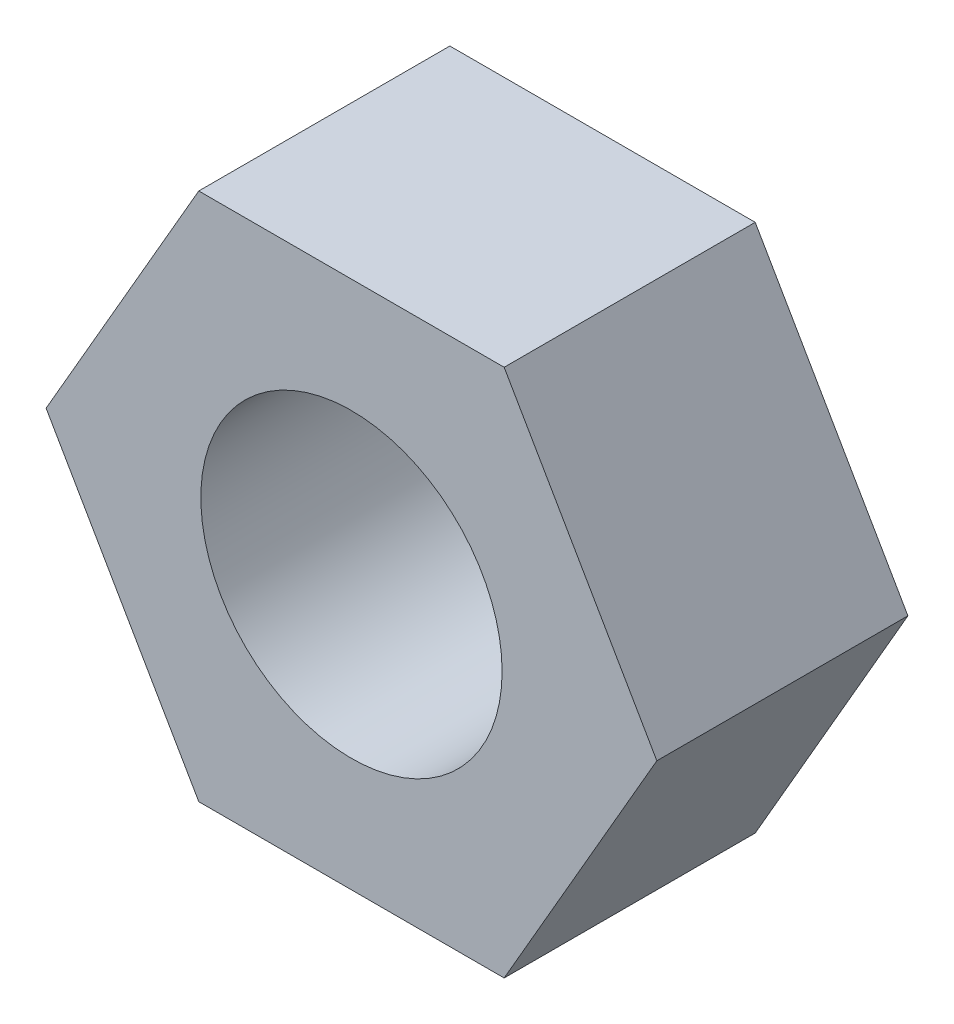
ISO-10303-21;
HEADER;
FILE_DESCRIPTION(('STEP AP214'),'2;1');
FILE_NAME('part.step','',(''),(''),'','','');
FILE_SCHEMA(('AUTOMOTIVE_DESIGN { 1 0 10303 214 1 1 1 1 }'));
ENDSEC;
DATA;
#1=APPLICATION_CONTEXT('core data for automotive mechanical design processes');
#2=APPLICATION_PROTOCOL_DEFINITION('international standard','automotive_design',2000,#1);
#3=PRODUCT_CONTEXT('',#1,'mechanical');
#4=PRODUCT('Part','Part','',(#3));
#5=PRODUCT_RELATED_PRODUCT_CATEGORY('part','',(#4));
#6=PRODUCT_DEFINITION_FORMATION('','',#4);
#7=PRODUCT_DEFINITION_CONTEXT('part definition',#1,'design');
#8=PRODUCT_DEFINITION('design','',#6,#7);
#9=PRODUCT_DEFINITION_SHAPE('','',#8);
#10=(LENGTH_UNIT() NAMED_UNIT(*) SI_UNIT(.MILLI.,.METRE.));
#11=(NAMED_UNIT(*) PLANE_ANGLE_UNIT() SI_UNIT($,.RADIAN.));
#12=(NAMED_UNIT(*) SI_UNIT($,.STERADIAN.) SOLID_ANGLE_UNIT());
#13=UNCERTAINTY_MEASURE_WITH_UNIT(LENGTH_MEASURE(1.E-05),#10,'distance_accuracy_value','');
#14=(GEOMETRIC_REPRESENTATION_CONTEXT(3) GLOBAL_UNCERTAINTY_ASSIGNED_CONTEXT((#13)) GLOBAL_UNIT_ASSIGNED_CONTEXT((#10,
#11,#12)) REPRESENTATION_CONTEXT('',''));
#15=CARTESIAN_POINT('',(0.,0.,0.));
#16=DIRECTION('',(0.,0.,1.));
#17=DIRECTION('',(1.,0.,0.));
#18=AXIS2_PLACEMENT_3D('',#15,#16,#17);
#19=CARTESIAN_POINT('',(4.56106712659807,0.,3.75));
#20=DIRECTION('',(-0.866025403784438,-0.5,0.));
#21=DIRECTION('',(0.5,-0.866025403784439,0.));
#22=AXIS2_PLACEMENT_3D('',#19,#20,#21);
#23=PLANE('',#22);
#24=DIRECTION('',(-0.5,0.866025403784438,0.));
#25=VECTOR('',#24,1.);
#26=CARTESIAN_POINT('',(4.56106712659807,0.,0.));
#27=LINE('',#26,#25);
#28=CARTESIAN_POINT('',(4.56106712659807,0.,0.));
#29=VERTEX_POINT('',#28);
#30=CARTESIAN_POINT('',(2.28053356329905,3.95,0.));
#31=VERTEX_POINT('',#30);
#32=EDGE_CURVE('E116',#29,#31,#27,.T.);
#33=ORIENTED_EDGE('',*,*,#32,.T.);
#34=DIRECTION('',(0.,0.,-1.));
#35=VECTOR('',#34,1.);
#36=CARTESIAN_POINT('',(2.28053356329905,3.95,3.75));
#37=LINE('',#36,#35);
#38=CARTESIAN_POINT('',(2.28053356329905,3.95,3.75));
#39=VERTEX_POINT('',#38);
#40=EDGE_CURVE('E11',#39,#31,#37,.T.);
#41=ORIENTED_EDGE('',*,*,#40,.F.);
#42=DIRECTION('',(-0.5,0.866025403784438,0.));
#43=VECTOR('',#42,1.);
#44=CARTESIAN_POINT('',(4.56106712659807,0.,3.75));
#45=LINE('',#44,#43);
#46=CARTESIAN_POINT('',(4.56106712659807,0.,3.75));
#47=VERTEX_POINT('',#46);
#48=EDGE_CURVE('E127',#47,#39,#45,.T.);
#49=ORIENTED_EDGE('',*,*,#48,.F.);
#50=DIRECTION('',(0.,0.,-1.));
#51=VECTOR('',#50,1.);
#52=CARTESIAN_POINT('',(4.56106712659807,0.,3.75));
#53=LINE('',#52,#51);
#54=EDGE_CURVE('E112',#47,#29,#53,.T.);
#55=ORIENTED_EDGE('',*,*,#54,.T.);
#56=EDGE_LOOP('',(#33,#41,#49,#55));
#57=FACE_BOUND('',#56,.T.);
#58=ADVANCED_FACE('F32',(#57),#23,.F.);
#59=CARTESIAN_POINT('',(2.28053356329905,3.95,3.75));
#60=DIRECTION('',(0.,-1.,0.));
#61=DIRECTION('',(0.,0.,-1.));
#62=AXIS2_PLACEMENT_3D('',#59,#60,#61);
#63=PLANE('',#62);
#64=DIRECTION('',(-1.,0.,0.));
#65=VECTOR('',#64,1.);
#66=CARTESIAN_POINT('',(2.28053356329905,3.95,0.));
#67=LINE('',#66,#65);
#68=CARTESIAN_POINT('',(-2.280533563299,3.95,0.));
#69=VERTEX_POINT('',#68);
#70=EDGE_CURVE('E119',#31,#69,#67,.T.);
#71=ORIENTED_EDGE('',*,*,#70,.T.);
#72=DIRECTION('',(0.,0.,-1.));
#73=VECTOR('',#72,1.);
#74=CARTESIAN_POINT('',(-2.280533563299,3.95,3.75));
#75=LINE('',#74,#73);
#76=CARTESIAN_POINT('',(-2.280533563299,3.95,3.75));
#77=VERTEX_POINT('',#76);
#78=EDGE_CURVE('E40',#77,#69,#75,.T.);
#79=ORIENTED_EDGE('',*,*,#78,.F.);
#80=DIRECTION('',(-1.,0.,0.));
#81=VECTOR('',#80,1.);
#82=CARTESIAN_POINT('',(2.28053356329905,3.95,3.75));
#83=LINE('',#82,#81);
#84=EDGE_CURVE('E85',#39,#77,#83,.T.);
#85=ORIENTED_EDGE('',*,*,#84,.F.);
#86=ORIENTED_EDGE('',*,*,#40,.T.);
#87=EDGE_LOOP('',(#71,#79,#85,#86));
#88=FACE_BOUND('',#87,.T.);
#89=ADVANCED_FACE('F152',(#88),#63,.F.);
#90=CARTESIAN_POINT('',(-2.280533563299,3.95,3.75));
#91=DIRECTION('',(0.866025403784439,-0.5,0.));
#92=DIRECTION('',(0.5,0.866025403784439,0.));
#93=AXIS2_PLACEMENT_3D('',#90,#91,#92);
#94=PLANE('',#93);
#95=DIRECTION('',(-0.5,-0.866025403784439,0.));
#96=VECTOR('',#95,1.);
#97=CARTESIAN_POINT('',(-2.280533563299,3.95,0.));
#98=LINE('',#97,#96);
#99=CARTESIAN_POINT('',(-4.56106712659803,0.,0.));
#100=VERTEX_POINT('',#99);
#101=EDGE_CURVE('E122',#69,#100,#98,.T.);
#102=ORIENTED_EDGE('',*,*,#101,.T.);
#103=DIRECTION('',(0.,0.,-1.));
#104=VECTOR('',#103,1.);
#105=CARTESIAN_POINT('',(-4.56106712659803,0.,3.75));
#106=LINE('',#105,#104);
#107=CARTESIAN_POINT('',(-4.56106712659803,0.,3.75));
#108=VERTEX_POINT('',#107);
#109=EDGE_CURVE('E107',#108,#100,#106,.T.);
#110=ORIENTED_EDGE('',*,*,#109,.F.);
#111=DIRECTION('',(-0.5,-0.866025403784439,0.));
#112=VECTOR('',#111,1.);
#113=CARTESIAN_POINT('',(-2.280533563299,3.95,3.75));
#114=LINE('',#113,#112);
#115=EDGE_CURVE('E98',#77,#108,#114,.T.);
#116=ORIENTED_EDGE('',*,*,#115,.F.);
#117=ORIENTED_EDGE('',*,*,#78,.T.);
#118=EDGE_LOOP('',(#102,#110,#116,#117));
#119=FACE_BOUND('',#118,.T.);
#120=ADVANCED_FACE('F133',(#119),#94,.F.);
#121=CARTESIAN_POINT('',(-4.56106712659803,0.,3.75));
#122=DIRECTION('',(0.866025403784438,0.500000000000001,0.));
#123=DIRECTION('',(-0.500000000000001,0.866025403784438,0.));
#124=AXIS2_PLACEMENT_3D('',#121,#122,#123);
#125=PLANE('',#124);
#126=DIRECTION('',(0.500000000000001,-0.866025403784438,0.));
#127=VECTOR('',#126,1.);
#128=CARTESIAN_POINT('',(-4.56106712659803,0.,0.));
#129=LINE('',#128,#127);
#130=CARTESIAN_POINT('',(-2.280533563299,-3.95000000000002,0.));
#131=VERTEX_POINT('',#130);
#132=EDGE_CURVE('E106',#100,#131,#129,.T.);
#133=ORIENTED_EDGE('',*,*,#132,.T.);
#134=DIRECTION('',(0.,0.,-1.));
#135=VECTOR('',#134,1.);
#136=CARTESIAN_POINT('',(-2.280533563299,-3.95000000000002,3.75));
#137=LINE('',#136,#135);
#138=CARTESIAN_POINT('',(-2.280533563299,-3.95000000000002,3.75));
#139=VERTEX_POINT('',#138);
#140=EDGE_CURVE('E103',#139,#131,#137,.T.);
#141=ORIENTED_EDGE('',*,*,#140,.F.);
#142=DIRECTION('',(0.500000000000001,-0.866025403784438,0.));
#143=VECTOR('',#142,1.);
#144=CARTESIAN_POINT('',(-4.56106712659803,0.,3.75));
#145=LINE('',#144,#143);
#146=EDGE_CURVE('E92',#108,#139,#145,.T.);
#147=ORIENTED_EDGE('',*,*,#146,.F.);
#148=ORIENTED_EDGE('',*,*,#109,.T.);
#149=EDGE_LOOP('',(#133,#141,#147,#148));
#150=FACE_BOUND('',#149,.T.);
#151=ADVANCED_FACE('F104',(#150),#125,.F.);
#152=CARTESIAN_POINT('',(-2.280533563299,-3.95000000000002,3.75));
#153=DIRECTION('',(0.,1.,0.));
#154=DIRECTION('',(-1.,0.,0.));
#155=AXIS2_PLACEMENT_3D('',#152,#153,#154);
#156=PLANE('',#155);
#157=DIRECTION('',(1.,0.,0.));
#158=VECTOR('',#157,1.);
#159=CARTESIAN_POINT('',(-2.280533563299,-3.95000000000002,0.));
#160=LINE('',#159,#158);
#161=CARTESIAN_POINT('',(2.28053356329904,-3.95000000000003,0.));
#162=VERTEX_POINT('',#161);
#163=EDGE_CURVE('E71',#131,#162,#160,.T.);
#164=ORIENTED_EDGE('',*,*,#163,.T.);
#165=DIRECTION('',(0.,0.,-1.));
#166=VECTOR('',#165,1.);
#167=CARTESIAN_POINT('',(2.28053356329904,-3.95000000000003,3.75));
#168=LINE('',#167,#166);
#169=CARTESIAN_POINT('',(2.28053356329904,-3.95000000000003,3.75));
#170=VERTEX_POINT('',#169);
#171=EDGE_CURVE('E108',#170,#162,#168,.T.);
#172=ORIENTED_EDGE('',*,*,#171,.F.);
#173=DIRECTION('',(1.,0.,0.));
#174=VECTOR('',#173,1.);
#175=CARTESIAN_POINT('',(-2.280533563299,-3.95000000000002,3.75));
#176=LINE('',#175,#174);
#177=EDGE_CURVE('E96',#139,#170,#176,.T.);
#178=ORIENTED_EDGE('',*,*,#177,.F.);
#179=ORIENTED_EDGE('',*,*,#140,.T.);
#180=EDGE_LOOP('',(#164,#172,#178,#179));
#181=FACE_BOUND('',#180,.T.);
#182=ADVANCED_FACE('F110',(#181),#156,.F.);
#183=CARTESIAN_POINT('',(2.28053356329904,-3.95000000000003,3.75));
#184=DIRECTION('',(-0.866025403784439,0.5,0.));
#185=DIRECTION('',(-0.5,-0.866025403784439,0.));
#186=AXIS2_PLACEMENT_3D('',#183,#184,#185);
#187=PLANE('',#186);
#188=DIRECTION('',(0.5,0.866025403784439,0.));
#189=VECTOR('',#188,1.);
#190=CARTESIAN_POINT('',(2.28053356329904,-3.95000000000003,0.));
#191=LINE('',#190,#189);
#192=EDGE_CURVE('E77',#162,#29,#191,.T.);
#193=ORIENTED_EDGE('',*,*,#192,.T.);
#194=ORIENTED_EDGE('',*,*,#54,.F.);
#195=DIRECTION('',(0.5,0.866025403784439,0.));
#196=VECTOR('',#195,1.);
#197=CARTESIAN_POINT('',(2.28053356329904,-3.95000000000003,3.75));
#198=LINE('',#197,#196);
#199=EDGE_CURVE('E48',#170,#47,#198,.T.);
#200=ORIENTED_EDGE('',*,*,#199,.F.);
#201=ORIENTED_EDGE('',*,*,#171,.T.);
#202=EDGE_LOOP('',(#193,#194,#200,#201));
#203=FACE_BOUND('',#202,.T.);
#204=ADVANCED_FACE('F140',(#203),#187,.F.);
#205=CARTESIAN_POINT('',(2.28053356329905,3.95,3.75));
#206=DIRECTION('',(0.,0.,1.));
#207=DIRECTION('',(1.,0.,0.));
#208=AXIS2_PLACEMENT_3D('',#205,#206,#207);
#209=PLANE('',#208);
#210=CARTESIAN_POINT('',(0.,0.,3.75));
#211=DIRECTION('',(0.,0.,1.));
#212=DIRECTION('',(1.,0.,0.));
#213=AXIS2_PLACEMENT_3D('',#210,#211,#212);
#214=CIRCLE('',#213,2.25);
#215=CARTESIAN_POINT('',(2.25,0.,3.75));
#216=VERTEX_POINT('',#215);
#217=EDGE_CURVE('E207',#216,#216,#214,.T.);
#218=ORIENTED_EDGE('',*,*,#217,.F.);
#219=EDGE_LOOP('',(#218));
#220=FACE_BOUND('',#219,.T.);
#221=ORIENTED_EDGE('',*,*,#48,.T.);
#222=ORIENTED_EDGE('',*,*,#84,.T.);
#223=ORIENTED_EDGE('',*,*,#115,.T.);
#224=ORIENTED_EDGE('',*,*,#146,.T.);
#225=ORIENTED_EDGE('',*,*,#177,.T.);
#226=ORIENTED_EDGE('',*,*,#199,.T.);
#227=EDGE_LOOP('',(#221,#222,#223,#224,#225,#226));
#228=FACE_BOUND('',#227,.T.);
#229=ADVANCED_FACE('F94',(#220,#228),#209,.T.);
#230=CARTESIAN_POINT('',(2.28053356329905,3.95,0.));
#231=DIRECTION('',(0.,0.,1.));
#232=DIRECTION('',(1.,0.,0.));
#233=AXIS2_PLACEMENT_3D('',#230,#231,#232);
#234=PLANE('',#233);
#235=CARTESIAN_POINT('',(0.,0.,0.));
#236=DIRECTION('',(0.,0.,1.));
#237=DIRECTION('',(1.,0.,0.));
#238=AXIS2_PLACEMENT_3D('',#235,#236,#237);
#239=CIRCLE('',#238,2.25);
#240=CARTESIAN_POINT('',(2.25,0.,0.));
#241=VERTEX_POINT('',#240);
#242=EDGE_CURVE('E120',#241,#241,#239,.T.);
#243=ORIENTED_EDGE('',*,*,#242,.T.);
#244=EDGE_LOOP('',(#243));
#245=FACE_BOUND('',#244,.T.);
#246=ORIENTED_EDGE('',*,*,#32,.F.);
#247=ORIENTED_EDGE('',*,*,#192,.F.);
#248=ORIENTED_EDGE('',*,*,#163,.F.);
#249=ORIENTED_EDGE('',*,*,#132,.F.);
#250=ORIENTED_EDGE('',*,*,#101,.F.);
#251=ORIENTED_EDGE('',*,*,#70,.F.);
#252=EDGE_LOOP('',(#246,#247,#248,#249,#250,#251));
#253=FACE_BOUND('',#252,.T.);
#254=ADVANCED_FACE('F136',(#245,#253),#234,.F.);
#255=CARTESIAN_POINT('',(0.,0.,0.));
#256=DIRECTION('',(0.,0.,1.));
#257=DIRECTION('',(1.,0.,0.));
#258=AXIS2_PLACEMENT_3D('',#255,#256,#257);
#259=CYLINDRICAL_SURFACE('',#258,2.25);
#260=ORIENTED_EDGE('',*,*,#242,.F.);
#261=EDGE_LOOP('',(#260));
#262=FACE_BOUND('',#261,.T.);
#263=ORIENTED_EDGE('',*,*,#217,.T.);
#264=EDGE_LOOP('',(#263));
#265=FACE_BOUND('',#264,.T.);
#266=ADVANCED_FACE('F189',(#262,#265),#259,.F.);
#267=CLOSED_SHELL('',(#58,#89,#120,#151,#182,#204,#229,#254,#266));
#268=MANIFOLD_SOLID_BREP('B2',#267);
#269=ADVANCED_BREP_SHAPE_REPRESENTATION('',(#18,#268),#14);
#270=SHAPE_DEFINITION_REPRESENTATION(#9,#269);
ENDSEC;
END-ISO-10303-21;
